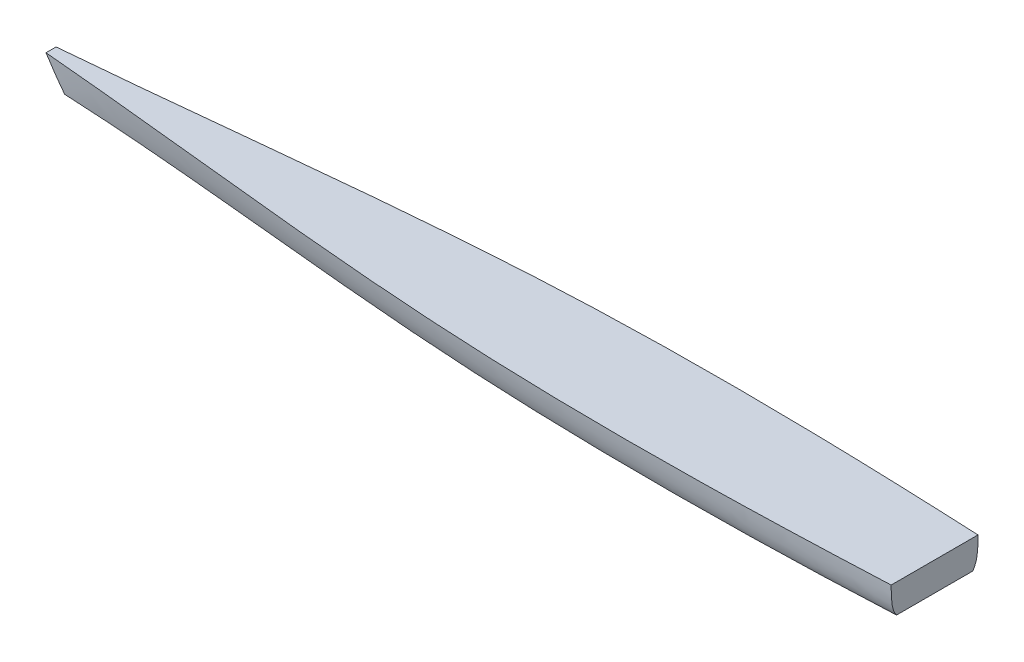
ISO-10303-21;
HEADER;
FILE_DESCRIPTION(('STEP AP214'),'2;1');
FILE_NAME('part.step','',(''),(''),'','','');
FILE_SCHEMA(('AUTOMOTIVE_DESIGN { 1 0 10303 214 1 1 1 1 }'));
ENDSEC;
DATA;
#1=APPLICATION_CONTEXT('core data for automotive mechanical design processes');
#2=APPLICATION_PROTOCOL_DEFINITION('international standard','automotive_design',2000,#1);
#3=PRODUCT_CONTEXT('',#1,'mechanical');
#4=PRODUCT('Part','Part','',(#3));
#5=PRODUCT_RELATED_PRODUCT_CATEGORY('part','',(#4));
#6=PRODUCT_DEFINITION_FORMATION('','',#4);
#7=PRODUCT_DEFINITION_CONTEXT('part definition',#1,'design');
#8=PRODUCT_DEFINITION('design','',#6,#7);
#9=PRODUCT_DEFINITION_SHAPE('','',#8);
#10=(LENGTH_UNIT() NAMED_UNIT(*) SI_UNIT(.MILLI.,.METRE.));
#11=(NAMED_UNIT(*) PLANE_ANGLE_UNIT() SI_UNIT($,.RADIAN.));
#12=(NAMED_UNIT(*) SI_UNIT($,.STERADIAN.) SOLID_ANGLE_UNIT());
#13=UNCERTAINTY_MEASURE_WITH_UNIT(LENGTH_MEASURE(1.E-05),#10,'distance_accuracy_value','');
#14=(GEOMETRIC_REPRESENTATION_CONTEXT(3) GLOBAL_UNCERTAINTY_ASSIGNED_CONTEXT((#13)) GLOBAL_UNIT_ASSIGNED_CONTEXT((#10,
#11,#12)) REPRESENTATION_CONTEXT('',''));
#15=CARTESIAN_POINT('',(0.,0.,0.));
#16=DIRECTION('',(0.,0.,1.));
#17=DIRECTION('',(1.,0.,0.));
#18=AXIS2_PLACEMENT_3D('',#15,#16,#17);
#19=CARTESIAN_POINT('',(0.,-0.100751445753044,0.));
#20=DIRECTION('',(0.,1.,0.));
#21=DIRECTION('',(-1.,0.,0.));
#22=AXIS2_PLACEMENT_3D('',#19,#20,#21);
#23=PLANE('',#22);
#24=DIRECTION('',(0.,0.,1.));
#25=VECTOR('',#24,1.);
#26=CARTESIAN_POINT('',(553.780953203146,-0.100751445753028,55.5625006612436));
#27=LINE('',#26,#25);
#28=CARTESIAN_POINT('',(553.780953203146,-0.100749882933223,-50.4725787140063));
#29=VERTEX_POINT('',#28);
#30=CARTESIAN_POINT('',(553.780953203146,-0.100749882933215,50.4725800364935));
#31=VERTEX_POINT('',#30);
#32=EDGE_CURVE('E226',#29,#31,#27,.T.);
#33=ORIENTED_EDGE('',*,*,#32,.T.);
#34=CARTESIAN_POINT('',(553.780953203146,-0.100751447117983,50.4725820433484));
#35=CARTESIAN_POINT('',(551.865367801599,-0.100751446256089,50.5725180783247));
#36=CARTESIAN_POINT('',(549.949717963459,-0.100751445890812,50.671213596536));
#37=CARTESIAN_POINT('',(546.118295301254,-0.100751445615244,50.8662016485795));
#38=CARTESIAN_POINT('',(544.202522477146,-0.100751445704952,50.9624941815644));
#39=CARTESIAN_POINT('',(538.454976668348,-0.100751445849178,51.2478869393229));
#40=CARTESIAN_POINT('',(534.623030055735,-0.100751445778793,51.4334995253199));
#41=CARTESIAN_POINT('',(526.958722383097,-0.100751445727264,51.7959434890552));
#42=CARTESIAN_POINT('',(523.126361323072,-0.10075144574612,51.9727748667807));
#43=CARTESIAN_POINT('',(515.461279667178,-0.100751445759937,52.3180760811833));
#44=CARTESIAN_POINT('',(511.628559072981,-0.100751445754898,52.4865459549756));
#45=CARTESIAN_POINT('',(503.962769939389,-0.10075144575116,52.8154655659478));
#46=CARTESIAN_POINT('',(500.129701399607,-0.100751445752462,52.9759152941311));
#47=CARTESIAN_POINT('',(491.185106593094,-0.100751445753786,53.3412814735624));
#48=CARTESIAN_POINT('',(486.073457008137,-0.100751445753237,53.5431859208654));
#49=CARTESIAN_POINT('',(475.849650180751,-0.100751445752823,53.9337245857599));
#50=CARTESIAN_POINT('',(470.737492938059,-0.100751445752958,54.1223587964094));
#51=CARTESIAN_POINT('',(455.400282460051,-0.100751445753175,54.6689237339102));
#52=CARTESIAN_POINT('',(445.174533839506,-0.10075144575307,55.0075150019046));
#53=CARTESIAN_POINT('',(424.72151728882,-0.100751445752993,55.6347409519789));
#54=CARTESIAN_POINT('',(414.494249359543,-0.100751445753021,55.9233756623821));
#55=CARTESIAN_POINT('',(394.037343709885,-0.100751445753043,56.4510789169399));
#56=CARTESIAN_POINT('',(383.807705853123,-0.100751445753036,56.6901421790284));
#57=CARTESIAN_POINT('',(363.347380421141,-0.10075144575303,57.1182607091595));
#58=CARTESIAN_POINT('',(353.116692845813,-0.100751445753032,57.3073159719852));
#59=CARTESIAN_POINT('',(332.654408784113,-0.100751445753036,57.6344671754329));
#60=CARTESIAN_POINT('',(322.422812289987,-0.100751445753037,57.7725626289184));
#61=CARTESIAN_POINT('',(296.831533946059,-0.100751445753038,58.0525921787504));
#62=CARTESIAN_POINT('',(281.471478884254,-0.100751445753036,58.1617701009789));
#63=CARTESIAN_POINT('',(250.750792727684,-0.100751445753036,58.2567462765992));
#64=CARTESIAN_POINT('',(235.390161628182,-0.100751445753037,58.2425430280051));
#65=CARTESIAN_POINT('',(204.669466424012,-0.100751445753038,58.0840948579493));
#66=CARTESIAN_POINT('',(189.30940232312,-0.100751445753038,57.9398491872406));
#67=CARTESIAN_POINT('',(158.590959890259,-0.100751445753039,57.5138232951473));
#68=CARTESIAN_POINT('',(143.232581578818,-0.10075144575304,57.2320415523869));
#69=CARTESIAN_POINT('',(120.19911009395,-0.10075144575304,56.69997485257));
#70=CARTESIAN_POINT('',(112.522723095048,-0.10075144575304,56.5044115295965));
#71=CARTESIAN_POINT('',(97.1709924492131,-0.100751445753041,56.0756812896961));
#72=CARTESIAN_POINT('',(89.495648802171,-0.100751445753041,55.8425143767012));
#73=CARTESIAN_POINT('',(74.146253310194,-0.100751445753042,55.3373888837126));
#74=CARTESIAN_POINT('',(66.4722014625867,-0.100751445753042,55.0654303849785));
#75=CARTESIAN_POINT('',(51.1256178855279,-0.100751445753042,54.4814597212883));
#76=CARTESIAN_POINT('',(43.4530861565953,-0.100751445753042,54.1694475426816));
#77=CARTESIAN_POINT('',(28.1099814502312,-0.100751445753043,53.5040456443998));
#78=CARTESIAN_POINT('',(20.439408432914,-0.100751445753043,53.1506568481375));
#79=CARTESIAN_POINT('',(8.93512896749031,-0.100751445753043,52.5884686769341));
#80=CARTESIAN_POINT('',(5.1006323545617,-0.100751445753044,52.39572178307));
#81=CARTESIAN_POINT('',(-2.56779952630319,-0.100751445753044,51.9993495219662));
#82=CARTESIAN_POINT('',(-6.40173479428531,-0.100751445753044,51.7957241556149));
#83=CARTESIAN_POINT('',(-14.0689070572772,-0.100751445753044,51.3773705829918));
#84=CARTESIAN_POINT('',(-17.9021440668496,-0.100751445753044,51.1626426435752));
#85=CARTESIAN_POINT('',(-25.5679780404939,-0.100751445753044,50.7220509716331));
#86=CARTESIAN_POINT('',(-29.4005750045372,-0.100751445753044,50.4961872386118));
#87=CARTESIAN_POINT('',(-37.0651245925135,-0.100751445753045,50.0337098198147));
#88=CARTESIAN_POINT('',(-40.8970772156897,-0.100751445753045,49.7970961215037));
#89=CARTESIAN_POINT('',(-48.5603236103653,-0.100751445753045,49.3134464328087));
#90=CARTESIAN_POINT('',(-52.3916173818574,-0.100751445753044,49.0664104423121));
#91=CARTESIAN_POINT('',(-63.7369537534638,-0.100751445753044,48.3199077551176));
#92=CARTESIAN_POINT('',(-71.2500570629486,-0.100751445753045,47.806105649681));
#93=CARTESIAN_POINT('',(-86.2737270336239,-0.100751445753047,46.7425269425514));
#94=CARTESIAN_POINT('',(-93.784293688463,-0.100751445753046,46.1927502514439));
#95=CARTESIAN_POINT('',(-108.802935444031,-0.100751445753047,45.0601487878065));
#96=CARTESIAN_POINT('',(-116.311010543435,-0.100751445753047,44.4773239977344));
#97=CARTESIAN_POINT('',(-131.324876976943,-0.100751445753047,43.281690996061));
#98=CARTESIAN_POINT('',(-138.8306682767,-0.100751445753048,42.6688823539599));
#99=CARTESIAN_POINT('',(-153.840006093506,-0.100751445753048,41.4165087692665));
#100=CARTESIAN_POINT('',(-161.343552613071,-0.100751445753048,40.7769438567745));
#101=CARTESIAN_POINT('',(-176.34860878234,-0.100751445753049,39.4744221547979));
#102=CARTESIAN_POINT('',(-183.850118432665,-0.100751445753049,38.8114653724592));
#103=CARTESIAN_POINT('',(-202.60337004184,-0.100751445753049,37.1290422181432));
#104=CARTESIAN_POINT('',(-213.853994435213,-0.10075144575305,36.097130202494));
#105=CARTESIAN_POINT('',(-236.352210583006,-0.10075144575305,34.0008837026564));
#106=CARTESIAN_POINT('',(-247.599802336371,-0.100751445753051,32.9365492071997));
#107=CARTESIAN_POINT('',(-270.093047337007,-0.100751445753051,30.788499717067));
#108=CARTESIAN_POINT('',(-281.338700597516,-0.100751445753051,29.704784860494));
#109=CARTESIAN_POINT('',(-303.829444362297,-0.100751445753053,27.5315923928462));
#110=CARTESIAN_POINT('',(-315.074534866733,-0.100751445753056,26.4421147834511));
#111=CARTESIAN_POINT('',(-337.561964898998,-0.100751445753056,24.2719039085056));
#112=CARTESIAN_POINT('',(-348.804304168735,-0.100751445753054,23.1911679802133));
#113=CARTESIAN_POINT('',(-371.291179400106,-0.100751445753054,21.0527009703042));
#114=CARTESIAN_POINT('',(-382.535715361407,-0.100751445753058,19.9949698852017));
#115=CARTESIAN_POINT('',(-405.027055834903,-0.100751445753052,17.9175969643962));
#116=CARTESIAN_POINT('',(-416.273859954357,-0.100751445753043,16.8979508948829));
#117=CARTESIAN_POINT('',(-438.772214474882,-0.100751445753068,14.9118130765846));
#118=CARTESIAN_POINT('',(-450.023764885271,-0.100751445753102,13.9453214326473));
#119=CARTESIAN_POINT('',(-468.783989297727,-0.100751445753026,12.3912524295702));
#120=CARTESIAN_POINT('',(-476.291089582331,-0.100751445752961,11.7846895586198));
#121=CARTESIAN_POINT('',(-491.308020049472,-0.100751445753154,10.606460720745));
#122=CARTESIAN_POINT('',(-498.817850226152,-0.100751445753413,10.0347946793706));
#123=CARTESIAN_POINT('',(-513.840349347893,-0.100751445752704,8.9307666819258));
#124=CARTESIAN_POINT('',(-521.353018270893,-0.100751445751736,8.39840442647625));
#125=CARTESIAN_POINT('',(-536.383119194736,-0.100751445754382,7.37713936926576));
#126=CARTESIAN_POINT('',(-543.900551904753,-0.100751445757998,6.88824698213883));
#127=CARTESIAN_POINT('',(-558.938451749861,-0.100751445748121,5.95817167181086));
#128=CARTESIAN_POINT('',(-566.458918911773,-0.100751445734629,5.51698918003007));
#129=CARTESIAN_POINT('',(-577.741869081478,-0.100751445762276,4.8938913596911));
#130=CARTESIAN_POINT('',(-581.503290572263,-0.100751445779472,4.69263501695441));
#131=CARTESIAN_POINT('',(-589.026827791943,-0.100751445726648,4.3034634330129));
#132=CARTESIAN_POINT('',(-592.788943521642,-0.100751445656627,4.1155482073831));
#133=CARTESIAN_POINT('',(-596.551395227938,-0.100751445491407,3.9345267445076));
#134=B_SPLINE_CURVE_WITH_KNOTS('',3,(#34,#35,#36,#37,#38,#39,#40,#41,#42,#43,#44,#45,#46,#47,
#48,#49,#50,#51,#52,#53,#54,#55,#56,#57,#58,#59,#60,#61,#62,#63,#64,#65,#66,#67,#68,#69,#70,#71,
#72,#73,#74,#75,#76,#77,#78,#79,#80,#81,#82,#83,#84,#85,#86,#87,#88,#89,#90,#91,#92,#93,#94,#95,
#96,#97,#98,#99,#100,#101,#102,#103,#104,#105,#106,#107,#108,#109,#110,#111,#112,#113,#114,#115,
#116,#117,#118,#119,#120,#121,#122,#123,#124,#125,#126,#127,#128,#129,#130,#131,#132,#133),
.UNSPECIFIED.,.F.,.F.,(4,2,2,2,2,2,2,2,2,2,2,2,2,2,2,2,2,2,2,2,2,2,2,2,2,2,2,2,2,2,2,2,2,2,2,2,
2,2,2,2,2,2,2,2,2,2,2,2,2,4),(0.,5.75457047516003,11.5091429796212,23.0184493321825,
34.527755701598,46.0370109786053,57.5462791657983,72.8931662508356,88.240061364038,
118.933981790681,149.627884815157,180.325056737706,211.022231862644,241.71970042125,
287.800533376194,333.881927298841,379.963586723854,426.045755899612,449.082313277404,
472.11886824646,495.155374959906,518.191889524279,541.227890074681,552.745891158344,
564.263891301248,575.781614732539,587.299338676687,598.81707605168,610.334813551178,
632.926665619109,655.518573840969,678.110494055005,700.702738732821,723.294957995395,
745.887170356351,779.780643688665,813.67412880068,847.567372486517,881.460606293422,
915.343094828043,949.225578228536,983.104283724092,1016.9830560434,1039.5776831286,
1062.17226200807,1084.76666876561,1107.36647425053,1129.96648407877,1141.26686860588,
1152.56726632536),.UNSPECIFIED.);
#135=CARTESIAN_POINT('',(-596.55139529419,-0.100751309566186,3.93452814665851));
#136=VERTEX_POINT('',#135);
#137=EDGE_CURVE('E165',#31,#136,#134,.T.);
#138=ORIENTED_EDGE('',*,*,#137,.T.);
#139=DIRECTION('',(0.,0.,-1.));
#140=VECTOR('',#139,1.);
#141=CARTESIAN_POINT('',(-596.551395215563,-0.100751445753063,5.95312566124441));
#142=LINE('',#141,#140);
#143=CARTESIAN_POINT('',(-596.55139529419,-0.10075130956628,-3.93452682417129));
#144=VERTEX_POINT('',#143);
#145=EDGE_CURVE('E11',#136,#144,#142,.T.);
#146=ORIENTED_EDGE('',*,*,#145,.T.);
#147=CARTESIAN_POINT('',(-596.551395221193,-0.100751440876937,-3.93452542387069));
#148=CARTESIAN_POINT('',(-591.026986441482,-0.100751444001736,-4.20030585205301));
#149=CARTESIAN_POINT('',(-585.503302298138,-0.100751445283742,-4.48097007238777));
#150=CARTESIAN_POINT('',(-574.457464285636,-0.100751446222377,-5.070603533796));
#151=CARTESIAN_POINT('',(-568.935310410869,-0.100751445879012,-5.37957266968873));
#152=CARTESIAN_POINT('',(-557.89272684903,-0.100751445627111,-6.02434640537681));
#153=CARTESIAN_POINT('',(-552.372297118171,-0.100751445718563,-6.36015025659977));
#154=CARTESIAN_POINT('',(-541.333032309038,-0.100751445787555,-7.05702746439727));
#155=CARTESIAN_POINT('',(-535.814197232317,-0.100751445765094,-7.41810084551203));
#156=CARTESIAN_POINT('',(-519.262648386861,-0.100751445728993,-8.53662199437139));
#157=CARTESIAN_POINT('',(-508.232319122091,-0.10075144574661,-9.32952243972863));
#158=CARTESIAN_POINT('',(-486.177746301788,-0.100751445759506,-10.9962640758493));
#159=CARTESIAN_POINT('',(-475.153502792806,-0.100751445754785,-11.8701058773632));
#160=CARTESIAN_POINT('',(-453.111757483439,-0.100751445751329,-13.6845052935154));
#161=CARTESIAN_POINT('',(-442.094255072815,-0.100751445752593,-14.6250555271237));
#162=CARTESIAN_POINT('',(-420.063902790547,-0.100751445753519,-16.5586577860871));
#163=CARTESIAN_POINT('',(-409.051052910444,-0.100751445753179,-17.5517097155681));
#164=CARTESIAN_POINT('',(-387.027674695279,-0.100751445752931,-19.5761535005366));
#165=CARTESIAN_POINT('',(-376.017146747781,-0.100751445753022,-20.6075495528666));
#166=CARTESIAN_POINT('',(-353.998389163077,-0.100751445753087,-22.6944897730277));
#167=CARTESIAN_POINT('',(-342.990159526039,-0.100751445753061,-23.7500339426162));
#168=CARTESIAN_POINT('',(-320.974119703534,-0.100751445753042,-25.8715518478386));
#169=CARTESIAN_POINT('',(-309.966309571371,-0.10075144575305,-26.9375261342587));
#170=CARTESIAN_POINT('',(-287.950394713984,-0.100751445753055,-29.0664812625718));
#171=CARTESIAN_POINT('',(-276.942289988662,-0.100751445753052,-30.1294621034635));
#172=CARTESIAN_POINT('',(-254.92448488346,-0.10075144575305,-32.2395509966809));
#173=CARTESIAN_POINT('',(-243.914784494085,-0.10075144575305,-33.2866589502846));
#174=CARTESIAN_POINT('',(-221.892726030774,-0.10075144575305,-35.3526416030744));
#175=CARTESIAN_POINT('',(-210.88036795784,-0.10075144575305,-36.3715163128762));
#176=CARTESIAN_POINT('',(-192.524644625063,-0.100751445753049,-38.0362066593729));
#177=CARTESIAN_POINT('',(-185.182287989331,-0.100751445753049,-38.6931327615621));
#178=CARTESIAN_POINT('',(-170.495712502697,-0.100751445753049,-39.9858957725509));
#179=CARTESIAN_POINT('',(-163.151493651189,-0.100751445753048,-40.6217326744842));
#180=CARTESIAN_POINT('',(-148.460980106989,-0.100751445753048,-41.869107956243));
#181=CARTESIAN_POINT('',(-141.114685411706,-0.100751445753048,-42.4806463055967));
#182=CARTESIAN_POINT('',(-126.419946725623,-0.100751445753047,-43.6763398512473));
#183=CARTESIAN_POINT('',(-119.071502759791,-0.100751445753047,-44.2604953538479));
#184=CARTESIAN_POINT('',(-104.372269648945,-0.100751445753047,-45.3984851608881));
#185=CARTESIAN_POINT('',(-97.021480505741,-0.100751445753046,-45.9523194886809));
#186=CARTESIAN_POINT('',(-82.3174991748319,-0.100751445753046,-47.0268557895541));
#187=CARTESIAN_POINT('',(-74.9643069950778,-0.100751445753046,-47.5475578711696));
#188=CARTESIAN_POINT('',(-62.0912859373432,-0.100751445753045,-48.4276535476638));
#189=CARTESIAN_POINT('',(-56.5719911281332,-0.100751445753045,-48.7948679585466));
#190=CARTESIAN_POINT('',(-45.532032538561,-0.100751445753045,-49.5080642598896));
#191=CARTESIAN_POINT('',(-40.0113687593734,-0.100751445753045,-49.8540461685027));
#192=CARTESIAN_POINT('',(-28.9686422159132,-0.100751445753044,-50.5237504768102));
#193=CARTESIAN_POINT('',(-23.4465794400359,-0.100751445753044,-50.8474726853575));
#194=CARTESIAN_POINT('',(-12.401138252852,-0.100751445753044,-51.4716599887258));
#195=CARTESIAN_POINT('',(-6.87775984130079,-0.100751445753044,-51.7721250792187));
#196=CARTESIAN_POINT('',(4.17020261037983,-0.100751445753044,-52.3503689760028));
#197=CARTESIAN_POINT('',(9.69478665463904,-0.100751445753043,-52.6281477033196));
#198=CARTESIAN_POINT('',(20.7450228946548,-0.100751445753043,-53.1615734322049));
#199=CARTESIAN_POINT('',(26.2706750905335,-0.100751445753043,-53.4172204312403));
#200=CARTESIAN_POINT('',(37.3229191725076,-0.100751445753043,-53.9069115222467));
#201=CARTESIAN_POINT('',(42.8495110555806,-0.100751445753042,-54.1409556824306));
#202=CARTESIAN_POINT('',(53.9035441776339,-0.100751445753042,-54.5879488295096));
#203=CARTESIAN_POINT('',(59.4309854165587,-0.100751445753042,-54.8008978177799));
#204=CARTESIAN_POINT('',(76.0172454052,-0.100751445753041,-55.4089415984302));
#205=CARTESIAN_POINT('',(87.0772119824959,-0.100751445753041,-55.7731101605416));
#206=CARTESIAN_POINT('',(109.199449679466,-0.100751445753041,-56.4226667603247));
#207=CARTESIAN_POINT('',(120.261720801786,-0.10075144575304,-56.70805470708));
#208=CARTESIAN_POINT('',(142.388007949701,-0.10075144575304,-57.2034418459972));
#209=CARTESIAN_POINT('',(153.452023984381,-0.100751445753039,-57.4134406317527));
#210=CARTESIAN_POINT('',(175.581218023315,-0.100751445753039,-57.7611877497625));
#211=CARTESIAN_POINT('',(186.64639603156,-0.100751445753038,-57.898935825142));
#212=CARTESIAN_POINT('',(212.556683913485,-0.100751445753038,-58.1403096394913));
#213=CARTESIAN_POINT('',(227.402057599018,-0.100751445753037,-58.2162134620921));
#214=CARTESIAN_POINT('',(257.092941281324,-0.100751445753036,-58.2496510546995));
#215=CARTESIAN_POINT('',(271.938451278334,-0.100751445753036,-58.2071845494132));
#216=CARTESIAN_POINT('',(301.628834000713,-0.100751445753035,-58.0094934539997));
#217=CARTESIAN_POINT('',(316.473706720627,-0.100751445753035,-57.8542680393072));
#218=CARTESIAN_POINT('',(338.739870222323,-0.100751445753034,-57.5402755558708));
#219=CARTESIAN_POINT('',(346.161757863013,-0.100751445753034,-57.4220851528873));
#220=CARTESIAN_POINT('',(361.005060185547,-0.100751445753033,-57.1590764292771));
#221=CARTESIAN_POINT('',(368.426474867701,-0.100751445753033,-57.0142581263652));
#222=CARTESIAN_POINT('',(383.265018931424,-0.100751445753033,-56.6984000937323));
#223=CARTESIAN_POINT('',(390.682148594585,-0.100751445753033,-56.5273735586687));
#224=CARTESIAN_POINT('',(405.515759533324,-0.100751445753032,-56.1592143970368));
#225=CARTESIAN_POINT('',(412.932240808961,-0.100751445753032,-55.9620817728886));
#226=CARTESIAN_POINT('',(427.76440372492,-0.100751445753031,-55.5416805783389));
#227=CARTESIAN_POINT('',(435.18008537112,-0.100751445753031,-55.3184122153171));
#228=CARTESIAN_POINT('',(450.010608973035,-0.100751445753031,-54.8454388345068));
#229=CARTESIAN_POINT('',(457.425450928448,-0.10075144575303,-54.5957338072575));
#230=CARTESIAN_POINT('',(472.254031153465,-0.10075144575303,-54.0692288059618));
#231=CARTESIAN_POINT('',(479.667769441467,-0.100751445753031,-53.792429350308));
#232=CARTESIAN_POINT('',(494.494134943463,-0.100751445753029,-53.2105850722551));
#233=CARTESIAN_POINT('',(501.906762158514,-0.100751445753026,-52.9055402769134));
#234=CARTESIAN_POINT('',(513.02465477028,-0.100751445753031,-52.4253946546348));
#235=CARTESIAN_POINT('',(516.730410295015,-0.100751445753034,-52.2615846480065));
#236=CARTESIAN_POINT('',(524.141565729447,-0.100751445753024,-51.9261089609627));
#237=CARTESIAN_POINT('',(527.846965639213,-0.100751445753011,-51.7544432820779));
#238=CARTESIAN_POINT('',(535.257385950423,-0.100751445753046,-51.4028774686021));
#239=CARTESIAN_POINT('',(538.962406350733,-0.100751445753093,-51.2229773100876));
#240=CARTESIAN_POINT('',(546.372015290313,-0.100751445752963,-50.8544487297704));
#241=CARTESIAN_POINT('',(550.076603829296,-0.100751445752786,-50.6658203022151));
#242=CARTESIAN_POINT('',(553.780953203146,-0.100751445752354,-50.4725807229853));
#243=B_SPLINE_CURVE_WITH_KNOTS('',3,(#147,#148,#149,#150,#151,#152,#153,#154,#155,#156,#157,
#158,#159,#160,#161,#162,#163,#164,#165,#166,#167,#168,#169,#170,#171,#172,#173,#174,#175,#176,
#177,#178,#179,#180,#181,#182,#183,#184,#185,#186,#187,#188,#189,#190,#191,#192,#193,#194,#195,
#196,#197,#198,#199,#200,#201,#202,#203,#204,#205,#206,#207,#208,#209,#210,#211,#212,#213,#214,
#215,#216,#217,#218,#219,#220,#221,#222,#223,#224,#225,#226,#227,#228,#229,#230,#231,#232,#233,
#234,#235,#236,#237,#238,#239,#240,#241,#242),.UNSPECIFIED.,.F.,.F.,(4,2,2,2,2,2,2,2,2,2,2,2,2,
2,2,2,2,2,2,2,2,2,2,2,2,2,2,2,2,2,2,2,2,2,2,2,2,2,2,2,2,2,2,2,2,2,2,4),(0.,16.5923626426887,
33.184663630854,49.7765019271068,66.3683563365536,99.5443363807423,132.720566777754,
165.893132062643,199.06563677267,232.241783032548,265.417931706787,298.595841881657,
331.77376315188,364.951890688817,398.130005750694,420.245038412381,442.360078274161,
464.475145868652,486.589966025507,508.704769149442,530.819499825679,547.413954443446,
564.008394873397,580.602977784238,597.197563783279,613.792207547948,630.386853211979,
646.981446475159,663.576038656595,696.77359627935,729.971192213518,763.168967105975,
796.366860026481,840.903036910463,885.439317371962,929.975923514518,952.244371034401,
974.512803739751,996.770061909348,1019.0273180157,1041.28439752903,1063.54148500745,
1085.79814672836,1108.05478712885,1119.18290323883,1130.31101718049,1141.43916345454,
1152.56731706287),.UNSPECIFIED.);
#244=EDGE_CURVE('E49',#144,#29,#243,.T.);
#245=ORIENTED_EDGE('',*,*,#244,.T.);
#246=EDGE_LOOP('',(#33,#138,#146,#245));
#247=FACE_BOUND('',#246,.T.);
#248=ADVANCED_FACE('F39',(#247),#23,.F.);
#249=CARTESIAN_POINT('',(0.,37.999248554247,0.));
#250=DIRECTION('',(0.,1.,0.));
#251=DIRECTION('',(-1.,0.,0.));
#252=AXIS2_PLACEMENT_3D('',#249,#250,#251);
#253=PLANE('',#252);
#254=DIRECTION('',(0.,0.,1.));
#255=VECTOR('',#254,1.);
#256=CARTESIAN_POINT('',(553.780953203146,37.999248554247,55.5625006612436));
#257=LINE('',#256,#255);
#258=CARTESIAN_POINT('',(553.780953203146,37.9992485520829,-57.5953656252869));
#259=VERTEX_POINT('',#258);
#260=CARTESIAN_POINT('',(553.780953203146,37.9992485520829,57.5953669477741));
#261=VERTEX_POINT('',#260);
#262=EDGE_CURVE('E97',#259,#261,#257,.T.);
#263=ORIENTED_EDGE('',*,*,#262,.F.);
#264=CARTESIAN_POINT('',(-618.548440471508,37.9992485540915,-6.67477749058266));
#265=CARTESIAN_POINT('',(-611.254557475778,37.9992485541911,-7.30036603929852));
#266=CARTESIAN_POINT('',(-603.961916728986,37.999248554232,-7.94029347931517));
#267=CARTESIAN_POINT('',(-589.379000600339,37.9992485542619,-9.24567333709082));
#268=CARTESIAN_POINT('',(-582.088725192894,37.999248554251,-9.91112546874787));
#269=CARTESIAN_POINT('',(-567.510278420478,37.9992485542429,-11.2644140920349));
#270=CARTESIAN_POINT('',(-560.22210704943,37.9992485542459,-11.9522505183553));
#271=CARTESIAN_POINT('',(-545.648355411309,37.999248554248,-13.3471622862599));
#272=CARTESIAN_POINT('',(-538.362774956185,37.9992485542472,-14.0542356655673));
#273=CARTESIAN_POINT('',(-523.793195976151,37.9992485542467,-15.4846653666936));
#274=CARTESIAN_POINT('',(-516.509197455393,37.9992485542469,-16.2080217307377));
#275=CARTESIAN_POINT('',(-501.942529625593,37.999248554247,-17.6680460092004));
#276=CARTESIAN_POINT('',(-494.659860317785,37.999248554247,-18.4047139359089));
#277=CARTESIAN_POINT('',(-480.095843915187,37.9992485542469,-19.8884152323871));
#278=CARTESIAN_POINT('',(-472.814496782239,37.9992485542469,-20.6354482280967));
#279=CARTESIAN_POINT('',(-458.252587353001,37.999248554247,-22.1370362078968));
#280=CARTESIAN_POINT('',(-450.972025055846,37.999248554247,-22.8915911836048));
#281=CARTESIAN_POINT('',(-436.411393123099,37.999248554247,-24.4054026049568));
#282=CARTESIAN_POINT('',(-429.131323487289,37.999248554247,-25.1646590485149));
#283=CARTESIAN_POINT('',(-414.57084632527,37.999248554247,-26.6851545849636));
#284=CARTESIAN_POINT('',(-407.290438813985,37.999248554247,-27.4463938205657));
#285=CARTESIAN_POINT('',(-392.729536388537,37.999248554247,-28.9680663389371));
#286=CARTESIAN_POINT('',(-385.44904147434,37.999248554247,-29.7284996213774));
#287=CARTESIAN_POINT('',(-370.887676564063,37.999248554247,-31.2458709953117));
#288=CARTESIAN_POINT('',(-363.606806567453,37.999248554247,-32.0028090817213));
#289=CARTESIAN_POINT('',(-345.401970577356,37.999248554247,-33.887660060014));
#290=CARTESIAN_POINT('',(-334.477605292482,37.999248554247,-35.011727034054));
#291=CARTESIAN_POINT('',(-312.626565290085,37.999248554247,-37.2372323916992));
#292=CARTESIAN_POINT('',(-301.69989057283,37.999248554247,-38.3386707779324));
#293=CARTESIAN_POINT('',(-279.843433512068,37.999248554247,-40.5103376337811));
#294=CARTESIAN_POINT('',(-268.913651168999,37.999248554247,-41.5805661078018));
#295=CARTESIAN_POINT('',(-247.050201644735,37.999248554247,-43.6814409692023));
#296=CARTESIAN_POINT('',(-236.116534438901,37.999248554247,-44.7120871008421));
#297=CARTESIAN_POINT('',(-214.246426341761,37.999248554247,-46.7254748910321));
#298=CARTESIAN_POINT('',(-203.309986109146,37.999248554247,-47.7082236855455));
#299=CARTESIAN_POINT('',(-181.432209227344,37.999248554247,-49.6180521707655));
#300=CARTESIAN_POINT('',(-170.490872567971,37.999248554247,-50.5451317451143));
#301=CARTESIAN_POINT('',(-148.603061462226,37.999248554247,-52.3359347357531));
#302=CARTESIAN_POINT('',(-137.656587043642,37.999248554247,-53.1996584908365));
#303=CARTESIAN_POINT('',(-115.758273499523,37.999248554247,-54.8563480261209));
#304=CARTESIAN_POINT('',(-104.806434378768,37.999248554247,-55.6493138692493));
#305=CARTESIAN_POINT('',(-85.0843262124903,37.999248554247,-57.0068604431564));
#306=CARTESIAN_POINT('',(-76.3150192845972,37.999248554247,-57.5854317163149));
#307=CARTESIAN_POINT('',(-58.7729808810726,37.999248554247,-58.689220116381));
#308=CARTESIAN_POINT('',(-50.0002493859864,37.999248554247,-59.2144369356225));
#309=CARTESIAN_POINT('',(-36.8387588651649,37.999248554247,-59.9597562517017));
#310=CARTESIAN_POINT('',(-32.4511951535423,37.999248554247,-60.2011117713807));
#311=CARTESIAN_POINT('',(-23.6752877472527,37.999248554247,-60.6692270817179));
#312=CARTESIAN_POINT('',(-19.2869440526793,37.999248554247,-60.8959868741274));
#313=CARTESIAN_POINT('',(-10.5095183400278,37.999248554247,-61.334634009432));
#314=CARTESIAN_POINT('',(-6.12043632277299,37.999248554247,-61.5465213688041));
#315=CARTESIAN_POINT('',(2.65840474462515,37.999248554247,-61.9557426522252));
#316=CARTESIAN_POINT('',(7.04816379485637,37.999248554247,-62.1530765743844));
#317=CARTESIAN_POINT('',(20.2183494041023,37.999248554247,-62.7236112971331));
#318=CARTESIAN_POINT('',(28.9997147288877,37.999248554247,-63.0753465649251));
#319=CARTESIAN_POINT('',(46.5665688293654,37.999248554247,-63.7236763242998));
#320=CARTESIAN_POINT('',(55.352058088976,37.999248554247,-64.0202576278254));
#321=CARTESIAN_POINT('',(72.9247113344044,37.999248554247,-64.5601354984491));
#322=CARTESIAN_POINT('',(81.7118753275772,37.999248554247,-64.8034318258701));
#323=CARTESIAN_POINT('',(99.2875143270716,37.999248554247,-65.2386523756636));
#324=CARTESIAN_POINT('',(108.075989339632,37.999248554247,-65.4305763452387));
#325=CARTESIAN_POINT('',(125.653891692456,37.999248554247,-65.7649179760481));
#326=CARTESIAN_POINT('',(134.443319034167,37.999248554247,-65.9073355610159));
#327=CARTESIAN_POINT('',(152.022764459583,37.999248554247,-66.1444902943087));
#328=CARTESIAN_POINT('',(160.812782539848,37.999248554247,-66.2392276996756));
#329=CARTESIAN_POINT('',(180.280976903077,37.999248554247,-66.3982351011177));
#330=CARTESIAN_POINT('',(190.959243158617,37.999248554247,-66.451592491942));
#331=CARTESIAN_POINT('',(212.315858508098,37.999248554247,-66.4937560135336));
#332=CARTESIAN_POINT('',(222.994207601652,37.999248554247,-66.4825623563203));
#333=CARTESIAN_POINT('',(244.350753545334,37.999248554247,-66.3987430516269));
#334=CARTESIAN_POINT('',(255.028950393296,37.999248554247,-66.3261168636163));
#335=CARTESIAN_POINT('',(276.384951314362,37.999248554247,-66.1225341719195));
#336=CARTESIAN_POINT('',(287.062755378565,37.999248554247,-65.991576744285));
#337=CARTESIAN_POINT('',(308.417731558116,37.999248554247,-65.6744452611134));
#338=CARTESIAN_POINT('',(319.09490365852,37.999248554247,-65.4882702058103));
#339=CARTESIAN_POINT('',(340.448376651938,37.999248554247,-65.0638639458922));
#340=CARTESIAN_POINT('',(351.124677528535,37.999248554247,-64.8256319194604));
#341=CARTESIAN_POINT('',(372.470657527331,37.999248554247,-64.3004947743402));
#342=CARTESIAN_POINT('',(383.140337261069,37.999248554247,-64.0136144099279));
#343=CARTESIAN_POINT('',(404.478346777991,37.999248554247,-63.3944713854109));
#344=CARTESIAN_POINT('',(415.146676564669,37.999248554247,-63.0622088452525));
#345=CARTESIAN_POINT('',(436.481762892323,37.999248554247,-62.3558638641727));
#346=CARTESIAN_POINT('',(447.148519457239,37.999248554247,-61.9817821438792));
#347=CARTESIAN_POINT('',(468.480244496932,37.999248554247,-61.1956104716839));
#348=CARTESIAN_POINT('',(479.145213022046,37.999248554247,-60.7835218806904));
#349=CARTESIAN_POINT('',(500.473160505816,37.999248554247,-59.9254626880787));
#350=CARTESIAN_POINT('',(511.136139544243,37.999248554247,-59.4794940643983));
#351=CARTESIAN_POINT('',(527.129198827629,37.999248554247,-58.7885211602315));
#352=CARTESIAN_POINT('',(532.459758583882,37.999248554247,-58.5545372122));
#353=CARTESIAN_POINT('',(543.120576497119,37.999248554247,-58.0798422782803));
#354=CARTESIAN_POINT('',(548.450834654226,37.999248554247,-57.8391312951558));
#355=CARTESIAN_POINT('',(553.780953203146,37.999248554247,-57.59536579586));
#356=B_SPLINE_CURVE_WITH_KNOTS('',3,(#264,#265,#266,#267,#268,#269,#270,#271,#272,#273,#274,
#275,#276,#277,#278,#279,#280,#281,#282,#283,#284,#285,#286,#287,#288,#289,#290,#291,#292,#293,
#294,#295,#296,#297,#298,#299,#300,#301,#302,#303,#304,#305,#306,#307,#308,#309,#310,#311,#312,
#313,#314,#315,#316,#317,#318,#319,#320,#321,#322,#323,#324,#325,#326,#327,#328,#329,#330,#331,
#332,#333,#334,#335,#336,#337,#338,#339,#340,#341,#342,#343,#344,#345,#346,#347,#348,#349,#350,
#351,#352,#353,#354,#355),.UNSPECIFIED.,.F.,.F.,(4,2,2,2,2,2,2,2,2,2,2,2,2,2,2,2,2,2,2,2,2,2,2,
2,2,2,2,2,2,2,2,2,2,2,2,2,2,2,2,2,2,2,2,2,2,4),(0.,21.9619535438301,43.9236609917359,
65.8853043688312,87.8447158732561,109.804184329617,131.763673060941,153.722371356867,
175.681045184581,197.63970927089,219.600000097448,241.560299885748,263.520631609382,
296.466747786836,329.412860138339,362.358967839739,395.305288368937,428.246685306237,
461.188151094087,494.129440715617,527.070701041039,553.435675670628,579.800802323999,
592.983373610424,606.165943315025,619.348498414459,632.531055225613,658.896077815116,
685.267396553972,711.638833909207,738.010401032845,764.382008782714,790.753474362833,
822.788460811874,854.823342041289,886.858505141016,918.894175685549,950.930426300854,
982.967182705017,1014.98768613784,1047.00810494113,1079.02797205372,1111.04669307885,
1143.06354626507,1159.0706206812,1175.0776885212),.UNSPECIFIED.);
#357=CARTESIAN_POINT('',(-618.548440493532,37.9992485920824,-6.67477874221268));
#358=VERTEX_POINT('',#357);
#359=EDGE_CURVE('E87',#358,#259,#356,.T.);
#360=ORIENTED_EDGE('',*,*,#359,.F.);
#361=DIRECTION('',(0.,0.,-1.));
#362=VECTOR('',#361,1.);
#363=CARTESIAN_POINT('',(-618.548440471688,37.999248554247,5.95312566124308));
#364=LINE('',#363,#362);
#365=CARTESIAN_POINT('',(-618.548440493532,37.9992485920826,6.6747800646999));
#366=VERTEX_POINT('',#365);
#367=EDGE_CURVE('E81',#366,#358,#364,.T.);
#368=ORIENTED_EDGE('',*,*,#367,.F.);
#369=CARTESIAN_POINT('',(553.780953203146,37.9992485526515,57.5953671183876));
#370=CARTESIAN_POINT('',(548.773863775971,37.999248553659,57.824358610984));
#371=CARTESIAN_POINT('',(543.766651202168,37.9992485540859,58.0506555824567));
#372=CARTESIAN_POINT('',(533.751961357981,37.999248554408,58.4973462605181));
#373=CARTESIAN_POINT('',(528.744484087519,37.9992485543032,58.7177399653521));
#374=CARTESIAN_POINT('',(513.721638554495,37.9992485541346,59.3692943631397));
#375=CARTESIAN_POINT('',(503.705850107362,37.9992485542169,59.7908286362804));
#376=CARTESIAN_POINT('',(483.672408576738,37.9992485542771,60.6044770850778));
#377=CARTESIAN_POINT('',(473.654755413547,37.9992485542551,60.9965893028213));
#378=CARTESIAN_POINT('',(453.61818848432,37.9992485542389,61.7479100720035));
#379=CARTESIAN_POINT('',(443.59927471538,37.9992485542448,62.1071185461973));
#380=CARTESIAN_POINT('',(423.558710673163,37.9992485542491,62.7894791214365));
#381=CARTESIAN_POINT('',(413.537060214784,37.9992485542476,63.1126258130186));
#382=CARTESIAN_POINT('',(393.492574065518,37.9992485542464,63.7198070272983));
#383=CARTESIAN_POINT('',(383.46973837394,37.9992485542468,64.0038415270844));
#384=CARTESIAN_POINT('',(353.39953527617,37.9992485542474,64.7929838819326));
#385=CARTESIAN_POINT('',(333.35045803407,37.9992485542471,65.2351310707742));
#386=CARTESIAN_POINT('',(293.248864842879,37.9992485542469,65.9300341238479));
#387=CARTESIAN_POINT('',(273.196348872376,37.9992485542469,66.1827887626213));
#388=CARTESIAN_POINT('',(233.089626123552,37.999248554247,66.478297978267));
#389=CARTESIAN_POINT('',(213.035419344502,37.999248554247,66.5210524642347));
#390=CARTESIAN_POINT('',(182.952007699737,37.999248554247,66.4121924269231));
#391=CARTESIAN_POINT('',(172.922439422535,37.999248554247,66.347052401767));
#392=CARTESIAN_POINT('',(152.863846813173,37.999248554247,66.1564458725016));
#393=CARTESIAN_POINT('',(142.83482248177,37.999248554247,66.0309792864952));
#394=CARTESIAN_POINT('',(122.777766392741,37.999248554247,65.7170429928329));
#395=CARTESIAN_POINT('',(112.749734634197,37.999248554247,65.5285733439867));
#396=CARTESIAN_POINT('',(92.6950966983782,37.999248554247,65.0858893690443));
#397=CARTESIAN_POINT('',(82.6684905238253,37.999248554247,64.8316749190322));
#398=CARTESIAN_POINT('',(62.6179441570982,37.999248554247,64.2547091505872));
#399=CARTESIAN_POINT('',(52.5940038276793,37.999248554247,63.9319626177642));
#400=CARTESIAN_POINT('',(32.5486620068867,37.999248554247,63.2150243452051));
#401=CARTESIAN_POINT('',(22.527260518186,37.999248554247,62.8208325305578));
#402=CARTESIAN_POINT('',(2.48770007210905,37.999248554247,61.9580362865375));
#403=CARTESIAN_POINT('',(-7.53045890132251,37.999248554247,61.4894322314422));
#404=CARTESIAN_POINT('',(-27.5627845177742,37.999248554247,60.4746976271747));
#405=CARTESIAN_POINT('',(-37.576951183482,37.999248554247,59.9285675250541));
#406=CARTESIAN_POINT('',(-60.9367980204662,37.999248554247,58.5694000729219));
#407=CARTESIAN_POINT('',(-74.2808337681335,37.999248554247,57.7280591879273));
#408=CARTESIAN_POINT('',(-100.961062938043,37.999248554247,55.9279722539985));
#409=CARTESIAN_POINT('',(-114.297256284012,37.999248554247,54.9692250815748));
#410=CARTESIAN_POINT('',(-140.961708819366,37.999248554247,52.947102534316));
#411=CARTESIAN_POINT('',(-154.289967990141,37.999248554247,51.8837269150418));
#412=CARTESIAN_POINT('',(-180.939887326812,37.999248554247,49.6657053752128));
#413=CARTESIAN_POINT('',(-194.261546907812,37.999248554247,48.5110524568616));
#414=CARTESIAN_POINT('',(-220.897850834626,37.999248554247,46.1245906247097));
#415=CARTESIAN_POINT('',(-234.212495219078,37.999248554247,44.8927821404401));
#416=CARTESIAN_POINT('',(-260.835812195969,37.999248554247,42.3665664286964));
#417=CARTESIAN_POINT('',(-274.144484792539,37.999248554247,41.0721592445879));
#418=CARTESIAN_POINT('',(-297.427018531123,37.999248554247,38.7656915849122));
#419=CARTESIAN_POINT('',(-307.401915607004,37.999248554247,37.7640410310622));
#420=CARTESIAN_POINT('',(-327.349636669713,37.999248554247,35.7405297357245));
#421=CARTESIAN_POINT('',(-337.322460660645,37.999248554247,34.7186690346333));
#422=CARTESIAN_POINT('',(-357.266348039343,37.999248554247,32.6614145402096));
#423=CARTESIAN_POINT('',(-367.237411477384,37.999248554247,31.6260212330342));
#424=CARTESIAN_POINT('',(-387.178836187673,37.999248554247,29.5484544579845));
#425=CARTESIAN_POINT('',(-397.149197459533,37.999248554247,28.5062809863996));
#426=CARTESIAN_POINT('',(-424.727352724643,37.999248554247,25.6237908998356));
#427=CARTESIAN_POINT('',(-442.335160053314,37.999248554247,23.7836076708801));
#428=CARTESIAN_POINT('',(-477.554984859184,37.999248554247,20.1428633934152));
#429=CARTESIAN_POINT('',(-495.167002353155,37.999248554247,18.3423025055079));
#430=CARTESIAN_POINT('',(-521.591550700482,37.9992485542469,15.701857670938));
#431=CARTESIAN_POINT('',(-530.401054819527,37.9992485542469,14.8317531438044));
#432=CARTESIAN_POINT('',(-548.022529995455,37.999248554247,13.1169976427017));
#433=CARTESIAN_POINT('',(-556.834501048375,37.9992485542471,12.2723466280856));
#434=CARTESIAN_POINT('',(-574.461497728975,37.9992485542469,10.6138656354532));
#435=CARTESIAN_POINT('',(-583.276523404176,37.9992485542466,9.80003616085711));
#436=CARTESIAN_POINT('',(-600.909905128208,37.9992485542473,8.20874545593284));
#437=CARTESIAN_POINT('',(-609.728261196302,37.9992485542483,7.43128443930268));
#438=CARTESIAN_POINT('',(-618.54844047169,37.9992485542506,6.67477881308257));
#439=B_SPLINE_CURVE_WITH_KNOTS('',3,(#369,#370,#371,#372,#373,#374,#375,#376,#377,#378,#379,
#380,#381,#382,#383,#384,#385,#386,#387,#388,#389,#390,#391,#392,#393,#394,#395,#396,#397,#398,
#399,#400,#401,#402,#403,#404,#405,#406,#407,#408,#409,#410,#411,#412,#413,#414,#415,#416,#417,
#418,#419,#420,#421,#422,#423,#424,#425,#426,#427,#428,#429,#430,#431,#432,#433,#434,#435,#436,
#437,#438),.UNSPECIFIED.,.F.,.F.,(4,2,2,2,2,2,2,2,2,2,2,2,2,2,2,2,2,2,2,2,2,2,2,2,2,2,2,2,2,2,2,
2,2,2,4),(0.,15.0369677035875,30.0739398764376,60.1478648129414,90.2237892701159,
120.299784331839,150.380284908878,180.460803106707,240.62179804013,300.783182240113,
360.944592482724,391.0337829461,421.123014257612,451.212217482685,481.301477420356,
511.388636909195,541.475827944955,571.56286765339,601.649733872876,641.760729171095,
681.872108331224,721.983581204109,762.098132220781,802.212459936461,842.32675986312,
872.401923449178,902.477026926292,932.551052913129,962.62509535956,1015.73621199278,
1068.8475438626,1095.40462206479,1121.96165785544,1148.51912722561,1175.07675262568),.UNSPECIFIED.);
#440=EDGE_CURVE('E85',#261,#366,#439,.T.);
#441=ORIENTED_EDGE('',*,*,#440,.F.);
#442=EDGE_LOOP('',(#263,#360,#368,#441));
#443=FACE_BOUND('',#442,.T.);
#444=ADVANCED_FACE('F84',(#443),#253,.T.);
#445=CARTESIAN_POINT('',(553.780953203146,11.0117485542469,55.5625006612436));
#446=DIRECTION('',(1.,0.,0.));
#447=DIRECTION('',(0.,0.,-1.));
#448=AXIS2_PLACEMENT_3D('',#445,#446,#447);
#449=PLANE('',#448);
#450=CARTESIAN_POINT('',(553.780953203146,-12.8007514457532,6.61243597210876E-07));
#451=CARTESIAN_POINT('',(553.780953203146,-12.8007514457532,-74.0833326720897));
#452=CARTESIAN_POINT('',(553.780953203146,8.36591522091353,-55.5624993387564));
#453=CARTESIAN_POINT('',(553.780953203146,114.199248554247,-55.5624993387564));
#454=B_SPLINE_CURVE_WITH_KNOTS('',3,(#450,#451,#452,#453),.UNSPECIFIED.,.F.,.F.,(4,4),(0.,1.),.UNSPECIFIED.);
#455=EDGE_CURVE('E180',#29,#259,#454,.T.);
#456=ORIENTED_EDGE('',*,*,#455,.T.);
#457=ORIENTED_EDGE('',*,*,#262,.T.);
#458=CARTESIAN_POINT('',(553.780953203146,-12.8007514457532,6.61243597210876E-07));
#459=CARTESIAN_POINT('',(553.780953203146,-12.8007514457532,74.0833339945769));
#460=CARTESIAN_POINT('',(553.780953203146,8.36591522091353,55.5625006612436));
#461=CARTESIAN_POINT('',(553.780953203146,114.199248554247,55.5625006612436));
#462=B_SPLINE_CURVE_WITH_KNOTS('',3,(#458,#459,#460,#461),.UNSPECIFIED.,.F.,.F.,(4,4),(0.,1.),.UNSPECIFIED.);
#463=EDGE_CURVE('E88',#31,#261,#462,.T.);
#464=ORIENTED_EDGE('',*,*,#463,.F.);
#465=ORIENTED_EDGE('',*,*,#32,.F.);
#466=EDGE_LOOP('',(#456,#457,#464,#465));
#467=FACE_BOUND('',#466,.T.);
#468=ADVANCED_FACE('F132',(#467),#449,.T.);
#469=CARTESIAN_POINT('',(553.780953203146,-12.8007514457532,6.61243597210876E-07));
#470=CARTESIAN_POINT('',(363.280953203146,-23.3840847790864,6.61243639510374E-07));
#471=CARTESIAN_POINT('',(-47.9138628846482,-33.984010045265,6.61243681876185E-07));
#472=CARTESIAN_POINT('',(-398.719046796854,-23.3840847790864,6.61243639510374E-07));
#473=CARTESIAN_POINT('',(-589.219046796854,-12.8007514457532,6.61243597210876E-07));
#474=CARTESIAN_POINT('',(553.780953203146,-12.8007514457532,-74.0833326720897));
#475=CARTESIAN_POINT('',(363.149270514041,-19.8563070013087,-78.3284004177268));
#476=CARTESIAN_POINT('',(-51.5452336226101,-37.5228491116064,-77.9584209778541));
#477=CARTESIAN_POINT('',(-390.703675687394,-19.8563070013087,-14.8284004177269));
#478=CARTESIAN_POINT('',(-589.219046796854,-12.8007514457532,-5.29166600542307));
#479=CARTESIAN_POINT('',(553.780953203146,8.36591522091353,-55.5624993387564));
#480=CARTESIAN_POINT('',(363.017587824936,4.83813744313578,-64.0526348300307));
#481=CARTESIAN_POINT('',(-40.8609521324241,39.2867906570279,-80.056732606557));
#482=CARTESIAN_POINT('',(-413.678455431684,37.347986589387,-27.010968163364));
#483=CARTESIAN_POINT('',(-620.209197650604,40.8757643671648,-7.9374993387564));
#484=CARTESIAN_POINT('',(553.780953203146,114.199248554247,-55.5624993387564));
#485=CARTESIAN_POINT('',(362.885905135831,114.199248554247,-68.2977025756679));
#486=CARTESIAN_POINT('',(-24.9367782549931,114.199248554247,-73.3539114446648));
#487=CARTESIAN_POINT('',(-447.996417655558,114.199248554247,-36.5477025756679));
#488=CARTESIAN_POINT('',(-662.542530983938,114.199248554247,-7.9374993387564));
#489=B_SPLINE_SURFACE_WITH_KNOTS('',3,3,((#469,#470,#471,#472,#473),(#474,#475,#476,#477,#478),
(#479,#480,#481,#482,#483),(#484,#485,#486,#487,#488)),.UNSPECIFIED.,.F.,.F.,.F.,(4,4),(4,1,4),
(0.,1.),(0.,0.48021814139568,1.),.UNSPECIFIED.);
#490=CARTESIAN_POINT('',(-662.542530983938,114.199248554247,-7.9374993387564));
#491=CARTESIAN_POINT('',(-620.209197650604,40.8757643671648,-7.9374993387564));
#492=CARTESIAN_POINT('',(-589.219046796854,-12.8007514457532,-5.29166600542307));
#493=CARTESIAN_POINT('',(-589.219046796854,-12.8007514457532,6.61243597210876E-07));
#494=B_SPLINE_CURVE_WITH_KNOTS('',3,(#490,#491,#492,#493),.UNSPECIFIED.,.F.,.F.,(4,4),(0.,1.),.UNSPECIFIED.);
#495=EDGE_CURVE('E101',#358,#144,#494,.T.);
#496=ORIENTED_EDGE('',*,*,#495,.F.);
#497=ORIENTED_EDGE('',*,*,#359,.T.);
#498=ORIENTED_EDGE('',*,*,#455,.F.);
#499=ORIENTED_EDGE('',*,*,#244,.F.);
#500=EDGE_LOOP('',(#496,#497,#498,#499));
#501=FACE_BOUND('',#500,.T.);
#502=ADVANCED_FACE('F125',(#501),#489,.F.);
#503=CARTESIAN_POINT('',(553.780953203146,-12.8007514457532,6.61243597210876E-07));
#504=CARTESIAN_POINT('',(363.280953203146,-23.3840847790864,6.61243554911379E-07));
#505=CARTESIAN_POINT('',(-47.9138628846482,-33.984010045265,6.61243512545567E-07));
#506=CARTESIAN_POINT('',(-398.719046796854,-23.3840847790864,6.61243554911379E-07));
#507=CARTESIAN_POINT('',(-589.219046796854,-12.8007514457532,6.61243597210876E-07));
#508=CARTESIAN_POINT('',(553.780953203146,-12.8007514457532,74.0833339945769));
#509=CARTESIAN_POINT('',(363.149270514041,-19.8563070013087,78.328401740214));
#510=CARTESIAN_POINT('',(-51.5452336226101,-37.5228491116064,77.9584223003413));
#511=CARTESIAN_POINT('',(-390.703675687394,-19.8563070013087,14.8284017402141));
#512=CARTESIAN_POINT('',(-589.219046796854,-12.8007514457532,5.29166732791026));
#513=CARTESIAN_POINT('',(553.780953203146,8.36591522091353,55.5625006612436));
#514=CARTESIAN_POINT('',(363.017587824936,4.83813744313578,64.0526361525179));
#515=CARTESIAN_POINT('',(-40.8609521324241,39.2867906570279,80.0567339290442));
#516=CARTESIAN_POINT('',(-413.678455431684,37.347986589387,27.0109694858512));
#517=CARTESIAN_POINT('',(-620.209197650604,40.8757643671648,7.9375006612436));
#518=CARTESIAN_POINT('',(553.780953203146,114.199248554247,55.5625006612436));
#519=CARTESIAN_POINT('',(362.885905135831,114.199248554247,68.2977038981551));
#520=CARTESIAN_POINT('',(-24.9367782549931,114.199248554247,73.353912767152));
#521=CARTESIAN_POINT('',(-447.996417655558,114.199248554247,36.5477038981551));
#522=CARTESIAN_POINT('',(-662.542530983938,114.199248554247,7.9375006612436));
#523=B_SPLINE_SURFACE_WITH_KNOTS('',3,3,((#503,#504,#505,#506,#507),(#508,#509,#510,#511,#512),
(#513,#514,#515,#516,#517),(#518,#519,#520,#521,#522)),.UNSPECIFIED.,.F.,.F.,.F.,(4,4),(4,1,4),
(0.,1.),(0.,0.48021814139568,1.),.UNSPECIFIED.);
#524=CARTESIAN_POINT('',(-662.542530983938,114.199248554247,7.9375006612436));
#525=CARTESIAN_POINT('',(-620.209197650604,40.8757643671648,7.9375006612436));
#526=CARTESIAN_POINT('',(-589.219046796854,-12.8007514457532,5.29166732791026));
#527=CARTESIAN_POINT('',(-589.219046796854,-12.8007514457532,6.61243597210876E-07));
#528=B_SPLINE_CURVE_WITH_KNOTS('',3,(#524,#525,#526,#527),.UNSPECIFIED.,.F.,.F.,(4,4),(0.,1.),.UNSPECIFIED.);
#529=EDGE_CURVE('E43',#366,#136,#528,.T.);
#530=ORIENTED_EDGE('',*,*,#463,.T.);
#531=ORIENTED_EDGE('',*,*,#440,.T.);
#532=ORIENTED_EDGE('',*,*,#529,.T.);
#533=ORIENTED_EDGE('',*,*,#137,.F.);
#534=EDGE_LOOP('',(#530,#531,#532,#533));
#535=FACE_BOUND('',#534,.T.);
#536=ADVANCED_FACE('F93',(#535),#523,.T.);
#537=CARTESIAN_POINT('',(-610.005788890396,23.2029419840911,5.9531256612436));
#538=DIRECTION('',(-0.866025403784437,-0.500000000000003,0.));
#539=DIRECTION('',(0.500000000000003,-0.866025403784437,0.));
#540=AXIS2_PLACEMENT_3D('',#537,#538,#539);
#541=PLANE('',#540);
#542=ORIENTED_EDGE('',*,*,#529,.F.);
#543=ORIENTED_EDGE('',*,*,#367,.T.);
#544=ORIENTED_EDGE('',*,*,#495,.T.);
#545=ORIENTED_EDGE('',*,*,#145,.F.);
#546=EDGE_LOOP('',(#542,#543,#544,#545));
#547=FACE_BOUND('',#546,.T.);
#548=ADVANCED_FACE('F100',(#547),#541,.T.);
#549=CLOSED_SHELL('',(#248,#444,#468,#502,#536,#548));
#550=MANIFOLD_SOLID_BREP('B2',#549);
#551=ADVANCED_BREP_SHAPE_REPRESENTATION('',(#18,#550),#14);
#552=SHAPE_DEFINITION_REPRESENTATION(#9,#551);
ENDSEC;
END-ISO-10303-21;
